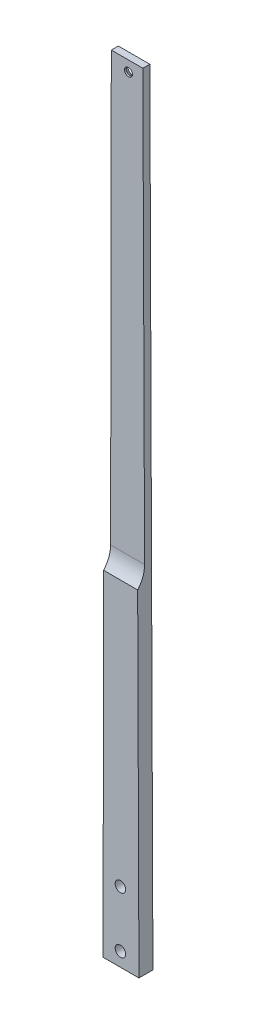
ISO-10303-21;
HEADER;
FILE_DESCRIPTION(('STEP AP214'),'2;1');
FILE_NAME('part.step','',(''),(''),'','','');
FILE_SCHEMA(('AUTOMOTIVE_DESIGN { 1 0 10303 214 1 1 1 1 }'));
ENDSEC;
DATA;
#1=APPLICATION_CONTEXT('core data for automotive mechanical design processes');
#2=APPLICATION_PROTOCOL_DEFINITION('international standard','automotive_design',2000,#1);
#3=PRODUCT_CONTEXT('',#1,'mechanical');
#4=PRODUCT('Part','Part','',(#3));
#5=PRODUCT_RELATED_PRODUCT_CATEGORY('part','',(#4));
#6=PRODUCT_DEFINITION_FORMATION('','',#4);
#7=PRODUCT_DEFINITION_CONTEXT('part definition',#1,'design');
#8=PRODUCT_DEFINITION('design','',#6,#7);
#9=PRODUCT_DEFINITION_SHAPE('','',#8);
#10=(LENGTH_UNIT() NAMED_UNIT(*) SI_UNIT(.MILLI.,.METRE.));
#11=(NAMED_UNIT(*) PLANE_ANGLE_UNIT() SI_UNIT($,.RADIAN.));
#12=(NAMED_UNIT(*) SI_UNIT($,.STERADIAN.) SOLID_ANGLE_UNIT());
#13=UNCERTAINTY_MEASURE_WITH_UNIT(LENGTH_MEASURE(1.E-05),#10,'distance_accuracy_value','');
#14=(GEOMETRIC_REPRESENTATION_CONTEXT(3) GLOBAL_UNCERTAINTY_ASSIGNED_CONTEXT((#13)) GLOBAL_UNIT_ASSIGNED_CONTEXT((#10,
#11,#12)) REPRESENTATION_CONTEXT('',''));
#15=CARTESIAN_POINT('',(0.,0.,0.));
#16=DIRECTION('',(0.,0.,1.));
#17=DIRECTION('',(1.,0.,0.));
#18=AXIS2_PLACEMENT_3D('',#15,#16,#17);
#19=CARTESIAN_POINT('',(-5.28708449601715,399.996,6.35));
#20=DIRECTION('',(0.,-1.,0.));
#21=DIRECTION('',(1.,0.,0.));
#22=AXIS2_PLACEMENT_3D('',#19,#20,#21);
#23=PLANE('',#22);
#24=DIRECTION('',(-1.,0.,0.));
#25=VECTOR('',#24,1.);
#26=CARTESIAN_POINT('',(-35.5509106008114,399.996,3.175));
#27=LINE('',#26,#25);
#28=CARTESIAN_POINT('',(9.04641692880041,399.996,3.175));
#29=VERTEX_POINT('',#28);
#30=CARTESIAN_POINT('',(-5.28708449601715,399.996,3.175));
#31=VERTEX_POINT('',#30);
#32=EDGE_CURVE('E113',#29,#31,#27,.T.);
#33=ORIENTED_EDGE('',*,*,#32,.F.);
#34=DIRECTION('',(0.,0.,-1.));
#35=VECTOR('',#34,1.);
#36=CARTESIAN_POINT('',(9.04641692880041,399.996,6.35));
#37=LINE('',#36,#35);
#38=CARTESIAN_POINT('',(9.04641692880041,399.996,0.));
#39=VERTEX_POINT('',#38);
#40=EDGE_CURVE('E181',#29,#39,#37,.T.);
#41=ORIENTED_EDGE('',*,*,#40,.T.);
#42=DIRECTION('',(-1.,0.,0.));
#43=VECTOR('',#42,1.);
#44=CARTESIAN_POINT('',(-5.28708449601715,399.996,0.));
#45=LINE('',#44,#43);
#46=CARTESIAN_POINT('',(-5.28708449601715,399.996,0.));
#47=VERTEX_POINT('',#46);
#48=EDGE_CURVE('E189',#39,#47,#45,.T.);
#49=ORIENTED_EDGE('',*,*,#48,.T.);
#50=DIRECTION('',(0.,0.,-1.));
#51=VECTOR('',#50,1.);
#52=CARTESIAN_POINT('',(-5.28708449601715,399.996,6.35));
#53=LINE('',#52,#51);
#54=EDGE_CURVE('E183',#31,#47,#53,.T.);
#55=ORIENTED_EDGE('',*,*,#54,.F.);
#56=EDGE_LOOP('',(#33,#41,#49,#55));
#57=FACE_BOUND('',#56,.T.);
#58=ADVANCED_FACE('F38',(#57),#23,.F.);
#59=CARTESIAN_POINT('',(2.51217831596574,395.2335,0.));
#60=DIRECTION('',(0.,0.,-1.));
#61=DIRECTION('',(-1.,0.,0.));
#62=AXIS2_PLACEMENT_3D('',#59,#60,#61);
#63=CYLINDRICAL_SURFACE('',#62,1.8288);
#64=CARTESIAN_POINT('',(2.51217831596574,395.2335,2.38137763978821));
#65=DIRECTION('',(0.,0.,-1.));
#66=DIRECTION('',(-1.,0.,0.));
#67=AXIS2_PLACEMENT_3D('',#64,#65,#66);
#68=CIRCLE('',#67,1.8288);
#69=CARTESIAN_POINT('',(0.683378315965738,395.2335,2.38137763978821));
#70=VERTEX_POINT('',#69);
#71=EDGE_CURVE('E134',#70,#70,#68,.T.);
#72=ORIENTED_EDGE('',*,*,#71,.T.);
#73=EDGE_LOOP('',(#72));
#74=FACE_BOUND('',#73,.T.);
#75=CARTESIAN_POINT('',(2.51217831596574,395.2335,3.175));
#76=DIRECTION('',(0.,0.,1.));
#77=DIRECTION('',(1.,0.,0.));
#78=AXIS2_PLACEMENT_3D('',#75,#76,#77);
#79=CIRCLE('',#78,1.8288);
#80=CARTESIAN_POINT('',(4.34097831596574,395.2335,3.175));
#81=VERTEX_POINT('',#80);
#82=EDGE_CURVE('E115',#81,#81,#79,.F.);
#83=ORIENTED_EDGE('',*,*,#82,.F.);
#84=EDGE_LOOP('',(#83));
#85=FACE_BOUND('',#84,.T.);
#86=ADVANCED_FACE('F168',(#74,#85),#63,.F.);
#87=CARTESIAN_POINT('',(10.4977022260614,29.9643245872979,6.35));
#88=CARTESIAN_POINT('',(10.3579391680048,67.7989887250294,6.35));
#89=CARTESIAN_POINT('',(10.0201544794482,157.80257599493,6.35));
#90=CARTESIAN_POINT('',(9.66771500819669,247.806107418328,6.35));
#91=CARTESIAN_POINT('',(9.3229525056798,333.315331774466,6.35));
#92=CARTESIAN_POINT('',(9.18606411784086,366.655671710222,6.35));
#93=CARTESIAN_POINT('',(9.04641692880041,399.996,6.35));
#94=B_SPLINE_CURVE_WITH_KNOTS('',3,(#87,#88,#89,#90,#91,#92,#93),.UNSPECIFIED.,.F.,.F.,(4,1,2,
4),(0.,0.306741017504105,0.729695864545239,1.),.UNSPECIFIED.);
#95=DIRECTION('',(0.,0.,-1.));
#96=VECTOR('',#95,1.);
#97=SURFACE_OF_LINEAR_EXTRUSION('',#94,#96);
#98=CARTESIAN_POINT('',(10.4977022260614,29.9643245872979,3.175));
#99=CARTESIAN_POINT('',(10.3579391680048,67.7989887250294,3.175));
#100=CARTESIAN_POINT('',(10.0201544794482,157.80257599493,3.175));
#101=CARTESIAN_POINT('',(9.66771500819669,247.806107418328,3.175));
#102=CARTESIAN_POINT('',(9.3229525056798,333.315331774466,3.175));
#103=CARTESIAN_POINT('',(9.18606411784086,366.655671710222,3.175));
#104=CARTESIAN_POINT('',(9.04641692880041,399.996,3.175));
#105=B_SPLINE_CURVE_WITH_KNOTS('',3,(#98,#99,#100,#101,#102,#103,#104),.UNSPECIFIED.,.F.,.F.,(4,
1,2,4),(0.,0.306741017504105,0.729695864545239,1.),.UNSPECIFIED.);
#106=CARTESIAN_POINT('',(9.83310345516962,205.19626041263,3.175));
#107=VERTEX_POINT('',#106);
#108=EDGE_CURVE('E102',#107,#29,#105,.T.);
#109=ORIENTED_EDGE('',*,*,#108,.F.);
#110=CARTESIAN_POINT('',(9.83310345513582,205.19626041263,3.175));
#111=CARTESIAN_POINT('',(9.83403087909923,204.958415509531,3.17499247087948));
#112=CARTESIAN_POINT('',(9.83495818721562,204.720571438755,3.18168124047176));
#113=CARTESIAN_POINT('',(9.83680965387325,204.245634259718,3.20839712795122));
#114=CARTESIAN_POINT('',(9.83773381242488,204.008541148978,3.2284242017747));
#115=CARTESIAN_POINT('',(9.83957607416271,203.535852086352,3.28176262079115));
#116=CARTESIAN_POINT('',(9.84049417730992,203.300256144104,3.3150740514291));
#117=CARTESIAN_POINT('',(9.84232291490128,202.830925481324,3.3949381616698));
#118=CARTESIAN_POINT('',(9.84323353475041,202.597194415948,3.44151231306713));
#119=CARTESIAN_POINT('',(9.84504290061525,202.132725845167,3.54773335974519));
#120=CARTESIAN_POINT('',(9.84594164701047,201.901988244092,3.60737983613853));
#121=CARTESIAN_POINT('',(9.84772435028309,201.444257575011,3.739546412053));
#122=CARTESIAN_POINT('',(9.84860830790293,201.21726431904,3.81206586318933));
#123=CARTESIAN_POINT('',(9.85079718801886,200.655114239211,4.00926167887641));
#124=CARTESIAN_POINT('',(9.85209128762189,200.322705029697,4.14187272721175));
#125=CARTESIAN_POINT('',(9.8546309599013,199.670246150278,4.43467368466598));
#126=CARTESIAN_POINT('',(9.8558765267388,199.350197967542,4.59486689965228));
#127=CARTESIAN_POINT('',(9.85830705469773,198.725578126764,4.94122304297471));
#128=CARTESIAN_POINT('',(9.8594921651959,198.420968336657,5.12731725725638));
#129=CARTESIAN_POINT('',(9.86179638689621,197.828626729997,5.52439724126177));
#130=CARTESIAN_POINT('',(9.86291553916851,197.540884411198,5.73536727064338));
#131=CARTESIAN_POINT('',(9.86430631255106,197.18325794127,6.02146583437368));
#132=CARTESIAN_POINT('',(9.86461192092945,197.104669978291,6.08589897004978));
#133=CARTESIAN_POINT('',(9.86521677953916,196.94912305434,6.21658257289285));
#134=CARTESIAN_POINT('',(9.86551603448512,196.872162885615,6.28283160249194));
#135=CARTESIAN_POINT('',(9.86581217806057,196.796,6.34999999999999));
#136=B_SPLINE_CURVE_WITH_KNOTS('',3,(#110,#111,#112,#113,#114,#115,#116,#117,#118,#119,#120,
#121,#122,#123,#124,#125,#126,#127,#128,#129,#130,#131,#132,#133,#134,#135),.UNSPECIFIED.,.F.,
.F.,(4,2,2,2,2,2,2,2,2,2,2,2,4),(0.,0.713444861550316,1.42688736621422,2.14033445981421,
2.85494322615147,3.56952909703283,4.28407898592627,5.35639076364407,6.42883115313344,
7.49847880061246,8.56745321710063,8.87231133920578,9.17693471733898),.UNSPECIFIED.);
#137=CARTESIAN_POINT('',(9.86581217806057,196.796,6.35));
#138=VERTEX_POINT('',#137);
#139=EDGE_CURVE('E52',#107,#138,#136,.T.);
#140=ORIENTED_EDGE('',*,*,#139,.T.);
#141=CARTESIAN_POINT('',(10.4440816928599,44.45,6.35));
#142=VERTEX_POINT('',#141);
#143=EDGE_CURVE('E100',#142,#138,#94,.T.);
#144=ORIENTED_EDGE('',*,*,#143,.F.);
#145=DIRECTION('',(0.,0.,-1.));
#146=VECTOR('',#145,1.);
#147=CARTESIAN_POINT('',(10.4440816928599,44.45,6.35));
#148=LINE('',#147,#146);
#149=CARTESIAN_POINT('',(10.4440816928599,44.45,0.));
#150=VERTEX_POINT('',#149);
#151=EDGE_CURVE('E151',#142,#150,#148,.T.);
#152=ORIENTED_EDGE('',*,*,#151,.T.);
#153=CARTESIAN_POINT('',(10.4977022260614,29.9643245872979,0.));
#154=CARTESIAN_POINT('',(10.3579391680048,67.7989887250294,0.));
#155=CARTESIAN_POINT('',(10.0201544794482,157.80257599493,0.));
#156=CARTESIAN_POINT('',(9.66771500819669,247.806107418328,0.));
#157=CARTESIAN_POINT('',(9.3229525056798,333.315331774466,0.));
#158=CARTESIAN_POINT('',(9.18606411784086,366.655671710222,0.));
#159=CARTESIAN_POINT('',(9.04641692880041,399.996,0.));
#160=B_SPLINE_CURVE_WITH_KNOTS('',3,(#153,#154,#155,#156,#157,#158,#159),.UNSPECIFIED.,.F.,.F.,
(4,1,2,4),(0.,0.306741017504105,0.729695864545239,1.),.UNSPECIFIED.);
#161=EDGE_CURVE('E152',#150,#39,#160,.T.);
#162=ORIENTED_EDGE('',*,*,#161,.T.);
#163=ORIENTED_EDGE('',*,*,#40,.F.);
#164=EDGE_LOOP('',(#109,#140,#144,#152,#162,#163));
#165=FACE_BOUND('',#164,.T.);
#166=ADVANCED_FACE('F98',(#165),#97,.F.);
#167=CARTESIAN_POINT('',(-5.28708449601715,399.996,6.35));
#168=CARTESIAN_POINT('',(-5.39197549250737,338.602231380514,6.35));
#169=CARTESIAN_POINT('',(-5.52953849339023,254.095503007995,6.35));
#170=CARTESIAN_POINT('',(-5.71814315412126,131.164770272772,6.35));
#171=CARTESIAN_POINT('',(-5.80863152532558,69.6278175841326,6.35));
#172=CARTESIAN_POINT('',(-5.86379750654596,31.2038199392675,6.35));
#173=B_SPLINE_CURVE_WITH_KNOTS('',3,(#167,#168,#169,#170,#171,#172),.UNSPECIFIED.,.F.,.F.,(4,1,
1,4),(0.,0.499417717587248,0.68743379950888,1.),.UNSPECIFIED.);
#174=DIRECTION('',(0.,0.,-1.));
#175=VECTOR('',#174,1.);
#176=SURFACE_OF_LINEAR_EXTRUSION('',#173,#175);
#177=CARTESIAN_POINT('',(-5.61721184025603,196.796,6.35));
#178=VERTEX_POINT('',#177);
#179=CARTESIAN_POINT('',(-5.84472654488417,44.45,6.35));
#180=VERTEX_POINT('',#179);
#181=EDGE_CURVE('E110',#178,#180,#173,.T.);
#182=ORIENTED_EDGE('',*,*,#181,.F.);
#183=CARTESIAN_POINT('',(-5.61721184025603,196.796,6.35));
#184=CARTESIAN_POINT('',(-5.61693608310515,196.974377902398,6.19267543773624));
#185=CARTESIAN_POINT('',(-5.61665344504512,197.157184320282,6.040373611593));
#186=CARTESIAN_POINT('',(-5.61607532162393,197.531056323594,5.74627035829035));
#187=CARTESIAN_POINT('',(-5.61577983630551,197.722121881548,5.60446889620736));
#188=CARTESIAN_POINT('',(-5.61517692910145,198.111916748259,5.33181936933783));
#189=CARTESIAN_POINT('',(-5.61486950713914,198.310646106244,5.20097137492866));
#190=CARTESIAN_POINT('',(-5.61424318352235,198.715466996848,4.95043735737793));
#191=CARTESIAN_POINT('',(-5.61392426399462,198.921569987803,4.83076985173149));
#192=CARTESIAN_POINT('',(-5.61327642223252,199.340177499266,4.60321934396371));
#193=CARTESIAN_POINT('',(-5.61294750031891,199.552681814496,4.49533596446133));
#194=CARTESIAN_POINT('',(-5.61228072099003,199.983397037189,4.29170108053239));
#195=CARTESIAN_POINT('',(-5.61194286402551,200.201607656775,4.19594896551751));
#196=CARTESIAN_POINT('',(-5.61108799952469,200.75364923563,3.97201890979975));
#197=CARTESIAN_POINT('',(-5.61056598922691,201.09066771392,3.85160927357716));
#198=CARTESIAN_POINT('',(-5.60950781325277,201.773676479233,3.63964886696507));
#199=CARTESIAN_POINT('',(-5.60897164588608,202.119667837519,3.5481015597469));
#200=CARTESIAN_POINT('',(-5.6078904103516,202.817220356157,3.39472057993135));
#201=CARTESIAN_POINT('',(-5.60734536899653,203.168764667031,3.33281015533952));
#202=CARTESIAN_POINT('',(-5.60624911012439,203.875658851902,3.23882126083724));
#203=CARTESIAN_POINT('',(-5.60569789671033,204.23100619153,3.20672404002061));
#204=CARTESIAN_POINT('',(-5.60498810424915,204.688468214795,3.18474810991549));
#205=CARTESIAN_POINT('',(-5.60483050086139,204.79003647606,3.18109127846491));
#206=CARTESIAN_POINT('',(-5.60451530205358,204.993153280969,3.17621852005121));
#207=CARTESIAN_POINT('',(-5.60435770672086,205.094701779563,3.17500071554446));
#208=CARTESIAN_POINT('',(-5.60420008435778,205.19626041263,3.175));
#209=B_SPLINE_CURVE_WITH_KNOTS('',3,(#183,#184,#185,#186,#187,#188,#189,#190,#191,#192,#193,
#194,#195,#196,#197,#198,#199,#200,#201,#202,#203,#204,#205,#206,#207,#208),.UNSPECIFIED.,.F.,
.F.,(4,2,2,2,2,2,2,2,2,2,2,2,4),(0.,0.713436737987538,1.42687110302095,2.14031005160588,
2.85491041775407,3.56948789245234,4.28402938688344,5.35632844479902,6.42875611822762,
7.49839124665395,8.56735317551277,8.87223665778535,9.17688535282129),.UNSPECIFIED.);
#210=CARTESIAN_POINT('',(-5.60420008435778,205.19626041263,3.175));
#211=VERTEX_POINT('',#210);
#212=EDGE_CURVE('E11',#178,#211,#209,.T.);
#213=ORIENTED_EDGE('',*,*,#212,.T.);
#214=CARTESIAN_POINT('',(-5.28708449601715,399.996,3.175));
#215=CARTESIAN_POINT('',(-5.39197549250737,338.602231380514,3.175));
#216=CARTESIAN_POINT('',(-5.52953849339023,254.095503007995,3.175));
#217=CARTESIAN_POINT('',(-5.71814315412126,131.164770272772,3.175));
#218=CARTESIAN_POINT('',(-5.80863152532558,69.6278175841326,3.175));
#219=CARTESIAN_POINT('',(-5.86379750654596,31.2038199392675,3.175));
#220=B_SPLINE_CURVE_WITH_KNOTS('',3,(#214,#215,#216,#217,#218,#219),.UNSPECIFIED.,.F.,.F.,(4,1,
1,4),(0.,0.499417717587248,0.68743379950888,1.),.UNSPECIFIED.);
#221=EDGE_CURVE('E118',#31,#211,#220,.T.);
#222=ORIENTED_EDGE('',*,*,#221,.F.);
#223=ORIENTED_EDGE('',*,*,#54,.T.);
#224=CARTESIAN_POINT('',(-5.28708449601715,399.996,0.));
#225=CARTESIAN_POINT('',(-5.39197549250737,338.602231380514,0.));
#226=CARTESIAN_POINT('',(-5.52953849339023,254.095503007995,0.));
#227=CARTESIAN_POINT('',(-5.71814315412126,131.164770272772,0.));
#228=CARTESIAN_POINT('',(-5.80863152532558,69.6278175841326,0.));
#229=CARTESIAN_POINT('',(-5.86379750654596,31.2038199392675,0.));
#230=B_SPLINE_CURVE_WITH_KNOTS('',3,(#224,#225,#226,#227,#228,#229),.UNSPECIFIED.,.F.,.F.,(4,1,
1,4),(0.,0.499417717587248,0.68743379950888,1.),.UNSPECIFIED.);
#231=CARTESIAN_POINT('',(-5.84472654488417,44.4500000013556,0.));
#232=VERTEX_POINT('',#231);
#233=EDGE_CURVE('E111',#47,#232,#230,.T.);
#234=ORIENTED_EDGE('',*,*,#233,.T.);
#235=DIRECTION('',(0.,0.,-1.));
#236=VECTOR('',#235,1.);
#237=CARTESIAN_POINT('',(-5.84472654488613,44.45,6.35));
#238=LINE('',#237,#236);
#239=EDGE_CURVE('E148',#232,#180,#238,.F.);
#240=ORIENTED_EDGE('',*,*,#239,.T.);
#241=EDGE_LOOP('',(#182,#213,#222,#223,#234,#240));
#242=FACE_BOUND('',#241,.T.);
#243=ADVANCED_FACE('F167',(#242),#176,.F.);
#244=CARTESIAN_POINT('',(9.7948897232855,214.980252046994,6.35));
#245=DIRECTION('',(0.,0.,-1.));
#246=DIRECTION('',(-1.,0.,0.));
#247=AXIS2_PLACEMENT_3D('',#244,#245,#246);
#248=PLANE('',#247);
#249=CARTESIAN_POINT('',(2.032,50.8,6.35));
#250=DIRECTION('',(0.,0.,1.));
#251=DIRECTION('',(1.,0.,0.));
#252=AXIS2_PLACEMENT_3D('',#249,#250,#251);
#253=CIRCLE('',#252,2.38125);
#254=CARTESIAN_POINT('',(4.41325,50.8,6.35));
#255=VERTEX_POINT('',#254);
#256=EDGE_CURVE('E137',#255,#255,#253,.T.);
#257=ORIENTED_EDGE('',*,*,#256,.F.);
#258=EDGE_LOOP('',(#257));
#259=FACE_BOUND('',#258,.T.);
#260=CARTESIAN_POINT('',(2.03199999999999,76.2,6.35));
#261=DIRECTION('',(0.,0.,1.));
#262=DIRECTION('',(1.,0.,0.));
#263=AXIS2_PLACEMENT_3D('',#260,#261,#262);
#264=CIRCLE('',#263,2.38125);
#265=CARTESIAN_POINT('',(4.41324999999999,76.2,6.35));
#266=VERTEX_POINT('',#265);
#267=EDGE_CURVE('E143',#266,#266,#264,.T.);
#268=ORIENTED_EDGE('',*,*,#267,.F.);
#269=EDGE_LOOP('',(#268));
#270=FACE_BOUND('',#269,.T.);
#271=ORIENTED_EDGE('',*,*,#143,.T.);
#272=DIRECTION('',(1.,0.,0.));
#273=VECTOR('',#272,1.);
#274=CARTESIAN_POINT('',(-35.5509106008114,196.796,6.35));
#275=LINE('',#274,#273);
#276=EDGE_CURVE('E107',#178,#138,#275,.T.);
#277=ORIENTED_EDGE('',*,*,#276,.F.);
#278=ORIENTED_EDGE('',*,*,#181,.T.);
#279=DIRECTION('',(-1.,0.,0.));
#280=VECTOR('',#279,1.);
#281=CARTESIAN_POINT('',(-9.398,44.45,6.35));
#282=LINE('',#281,#280);
#283=EDGE_CURVE('E109',#142,#180,#282,.T.);
#284=ORIENTED_EDGE('',*,*,#283,.F.);
#285=EDGE_LOOP('',(#271,#277,#278,#284));
#286=FACE_BOUND('',#285,.T.);
#287=ADVANCED_FACE('F106',(#259,#270,#286),#248,.F.);
#288=CARTESIAN_POINT('',(9.7948897232855,214.980252046994,0.));
#289=DIRECTION('',(0.,0.,-1.));
#290=DIRECTION('',(-1.,0.,0.));
#291=AXIS2_PLACEMENT_3D('',#288,#289,#290);
#292=PLANE('',#291);
#293=CARTESIAN_POINT('',(2.51217831596574,395.2335,0.));
#294=DIRECTION('',(0.,0.,-1.));
#295=DIRECTION('',(-1.,0.,0.));
#296=AXIS2_PLACEMENT_3D('',#293,#294,#295);
#297=CIRCLE('',#296,3.8989);
#298=CARTESIAN_POINT('',(-1.38672168403426,395.2335,0.));
#299=VERTEX_POINT('',#298);
#300=EDGE_CURVE('E128',#299,#299,#297,.T.);
#301=ORIENTED_EDGE('',*,*,#300,.F.);
#302=EDGE_LOOP('',(#301));
#303=FACE_BOUND('',#302,.T.);
#304=CARTESIAN_POINT('',(2.032,50.8,0.));
#305=DIRECTION('',(0.,0.,-1.));
#306=DIRECTION('',(-1.,0.,0.));
#307=AXIS2_PLACEMENT_3D('',#304,#305,#306);
#308=CIRCLE('',#307,2.38125);
#309=CARTESIAN_POINT('',(-0.349249999999997,50.8,0.));
#310=VERTEX_POINT('',#309);
#311=EDGE_CURVE('E140',#310,#310,#308,.T.);
#312=ORIENTED_EDGE('',*,*,#311,.F.);
#313=EDGE_LOOP('',(#312));
#314=FACE_BOUND('',#313,.T.);
#315=CARTESIAN_POINT('',(2.03199999999999,76.2,0.));
#316=DIRECTION('',(0.,0.,-1.));
#317=DIRECTION('',(-1.,0.,0.));
#318=AXIS2_PLACEMENT_3D('',#315,#316,#317);
#319=CIRCLE('',#318,2.38125);
#320=CARTESIAN_POINT('',(-0.349250000000003,76.2,0.));
#321=VERTEX_POINT('',#320);
#322=EDGE_CURVE('E146',#321,#321,#319,.T.);
#323=ORIENTED_EDGE('',*,*,#322,.F.);
#324=EDGE_LOOP('',(#323));
#325=FACE_BOUND('',#324,.T.);
#326=DIRECTION('',(1.,0.,0.));
#327=VECTOR('',#326,1.);
#328=CARTESIAN_POINT('',(9.7948897232855,44.45,0.));
#329=LINE('',#328,#327);
#330=EDGE_CURVE('E175',#232,#150,#329,.T.);
#331=ORIENTED_EDGE('',*,*,#330,.F.);
#332=ORIENTED_EDGE('',*,*,#233,.F.);
#333=ORIENTED_EDGE('',*,*,#48,.F.);
#334=ORIENTED_EDGE('',*,*,#161,.F.);
#335=EDGE_LOOP('',(#331,#332,#333,#334));
#336=FACE_BOUND('',#335,.T.);
#337=ADVANCED_FACE('F205',(#303,#314,#325,#336),#292,.T.);
#338=CARTESIAN_POINT('',(-9.398,44.45,-1.2E-05));
#339=DIRECTION('',(0.,1.,0.));
#340=DIRECTION('',(0.,0.,1.));
#341=AXIS2_PLACEMENT_3D('',#338,#339,#340);
#342=PLANE('',#341);
#343=ORIENTED_EDGE('',*,*,#283,.T.);
#344=ORIENTED_EDGE('',*,*,#239,.F.);
#345=ORIENTED_EDGE('',*,*,#330,.T.);
#346=ORIENTED_EDGE('',*,*,#151,.F.);
#347=EDGE_LOOP('',(#343,#344,#345,#346));
#348=FACE_BOUND('',#347,.T.);
#349=ADVANCED_FACE('F212',(#348),#342,.F.);
#350=CARTESIAN_POINT('',(2.03199999999999,76.2,6.35));
#351=DIRECTION('',(0.,0.,1.));
#352=DIRECTION('',(1.,0.,0.));
#353=AXIS2_PLACEMENT_3D('',#350,#351,#352);
#354=CYLINDRICAL_SURFACE('',#353,2.38125);
#355=ORIENTED_EDGE('',*,*,#322,.T.);
#356=EDGE_LOOP('',(#355));
#357=FACE_BOUND('',#356,.T.);
#358=ORIENTED_EDGE('',*,*,#267,.T.);
#359=EDGE_LOOP('',(#358));
#360=FACE_BOUND('',#359,.T.);
#361=ADVANCED_FACE('F214',(#357,#360),#354,.F.);
#362=CARTESIAN_POINT('',(2.032,50.8,6.35));
#363=DIRECTION('',(0.,0.,1.));
#364=DIRECTION('',(1.,0.,0.));
#365=AXIS2_PLACEMENT_3D('',#362,#363,#364);
#366=CYLINDRICAL_SURFACE('',#365,2.38125);
#367=ORIENTED_EDGE('',*,*,#311,.T.);
#368=EDGE_LOOP('',(#367));
#369=FACE_BOUND('',#368,.T.);
#370=ORIENTED_EDGE('',*,*,#256,.T.);
#371=EDGE_LOOP('',(#370));
#372=FACE_BOUND('',#371,.T.);
#373=ADVANCED_FACE('F220',(#369,#372),#366,.F.);
#374=CARTESIAN_POINT('',(2.51217831596574,395.2335,0.));
#375=DIRECTION('',(0.,0.,-1.));
#376=DIRECTION('',(-1.,0.,0.));
#377=AXIS2_PLACEMENT_3D('',#374,#375,#376);
#378=CONICAL_SURFACE('',#377,3.8989,0.715584993317675);
#379=ORIENTED_EDGE('',*,*,#71,.F.);
#380=EDGE_LOOP('',(#379));
#381=FACE_BOUND('',#380,.T.);
#382=ORIENTED_EDGE('',*,*,#300,.T.);
#383=EDGE_LOOP('',(#382));
#384=FACE_BOUND('',#383,.T.);
#385=ADVANCED_FACE('F237',(#381,#384),#378,.F.);
#386=CARTESIAN_POINT('',(0.,0.,3.175));
#387=DIRECTION('',(0.,0.,1.));
#388=DIRECTION('',(1.,0.,0.));
#389=AXIS2_PLACEMENT_3D('',#386,#387,#388);
#390=PLANE('',#389);
#391=ORIENTED_EDGE('',*,*,#82,.T.);
#392=EDGE_LOOP('',(#391));
#393=FACE_BOUND('',#392,.T.);
#394=ORIENTED_EDGE('',*,*,#221,.T.);
#395=DIRECTION('',(-1.,0.,0.));
#396=VECTOR('',#395,1.);
#397=CARTESIAN_POINT('',(9.86581217806057,205.19626041263,3.175));
#398=LINE('',#397,#396);
#399=EDGE_CURVE('E103',#211,#107,#398,.F.);
#400=ORIENTED_EDGE('',*,*,#399,.T.);
#401=ORIENTED_EDGE('',*,*,#108,.T.);
#402=ORIENTED_EDGE('',*,*,#32,.T.);
#403=EDGE_LOOP('',(#394,#400,#401,#402));
#404=FACE_BOUND('',#403,.T.);
#405=ADVANCED_FACE('F210',(#393,#404),#390,.T.);
#406=CARTESIAN_POINT('',(-35.5509106008114,205.19626041263,15.875));
#407=DIRECTION('',(1.,0.,0.));
#408=DIRECTION('',(0.,0.,-1.));
#409=AXIS2_PLACEMENT_3D('',#406,#407,#408);
#410=CYLINDRICAL_SURFACE('',#409,12.7);
#411=ORIENTED_EDGE('',*,*,#212,.F.);
#412=ORIENTED_EDGE('',*,*,#276,.T.);
#413=ORIENTED_EDGE('',*,*,#139,.F.);
#414=ORIENTED_EDGE('',*,*,#399,.F.);
#415=EDGE_LOOP('',(#411,#412,#413,#414));
#416=FACE_BOUND('',#415,.T.);
#417=ADVANCED_FACE('F40',(#416),#410,.F.);
#418=CLOSED_SHELL('',(#58,#86,#166,#243,#287,#337,#349,#361,#373,#385,#405,#417));
#419=MANIFOLD_SOLID_BREP('B2',#418);
#420=ADVANCED_BREP_SHAPE_REPRESENTATION('',(#18,#419),#14);
#421=SHAPE_DEFINITION_REPRESENTATION(#9,#420);
ENDSEC;
END-ISO-10303-21;
